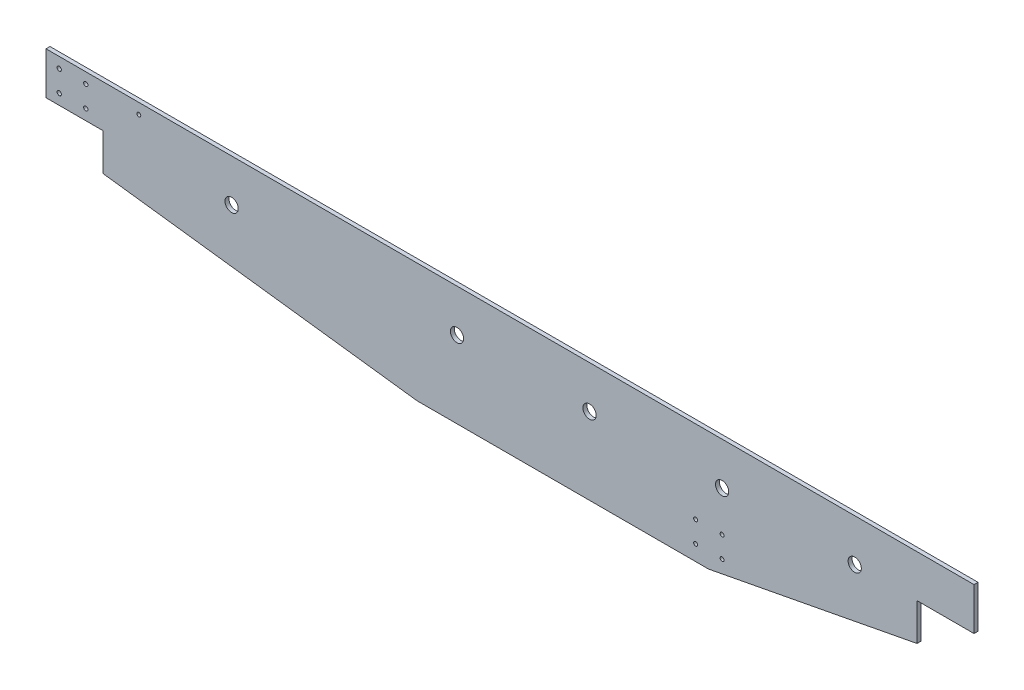
ISO-10303-21;
HEADER;
FILE_DESCRIPTION(('STEP AP214'),'2;1');
FILE_NAME('part.step','',(''),(''),'','','');
FILE_SCHEMA(('AUTOMOTIVE_DESIGN { 1 0 10303 214 1 1 1 1 }'));
ENDSEC;
DATA;
#1=APPLICATION_CONTEXT('core data for automotive mechanical design processes');
#2=APPLICATION_PROTOCOL_DEFINITION('international standard','automotive_design',2000,#1);
#3=PRODUCT_CONTEXT('',#1,'mechanical');
#4=PRODUCT('Part','Part','',(#3));
#5=PRODUCT_RELATED_PRODUCT_CATEGORY('part','',(#4));
#6=PRODUCT_DEFINITION_FORMATION('','',#4);
#7=PRODUCT_DEFINITION_CONTEXT('part definition',#1,'design');
#8=PRODUCT_DEFINITION('design','',#6,#7);
#9=PRODUCT_DEFINITION_SHAPE('','',#8);
#10=(LENGTH_UNIT() NAMED_UNIT(*) SI_UNIT(.MILLI.,.METRE.));
#11=(NAMED_UNIT(*) PLANE_ANGLE_UNIT() SI_UNIT($,.RADIAN.));
#12=(NAMED_UNIT(*) SI_UNIT($,.STERADIAN.) SOLID_ANGLE_UNIT());
#13=UNCERTAINTY_MEASURE_WITH_UNIT(LENGTH_MEASURE(1.E-05),#10,'distance_accuracy_value','');
#14=(GEOMETRIC_REPRESENTATION_CONTEXT(3) GLOBAL_UNCERTAINTY_ASSIGNED_CONTEXT((#13)) GLOBAL_UNIT_ASSIGNED_CONTEXT((#10,
#11,#12)) REPRESENTATION_CONTEXT('',''));
#15=CARTESIAN_POINT('',(0.,0.,0.));
#16=DIRECTION('',(0.,0.,1.));
#17=DIRECTION('',(1.,0.,0.));
#18=AXIS2_PLACEMENT_3D('',#15,#16,#17);
#19=CARTESIAN_POINT('',(0.,1.0096E-13,15.));
#20=DIRECTION('',(0.,0.,1.));
#21=DIRECTION('',(1.,0.,0.));
#22=AXIS2_PLACEMENT_3D('',#19,#20,#21);
#23=PLANE('',#22);
#24=CARTESIAN_POINT('',(-1700.,105.,15.));
#25=DIRECTION('',(0.,0.,1.));
#26=DIRECTION('',(1.,0.,0.));
#27=AXIS2_PLACEMENT_3D('',#24,#25,#26);
#28=CIRCLE('',#27,7.99999999999994);
#29=CARTESIAN_POINT('',(-1692.,105.,15.));
#30=VERTEX_POINT('',#29);
#31=EDGE_CURVE('E157',#30,#30,#28,.F.);
#32=ORIENTED_EDGE('',*,*,#31,.T.);
#33=EDGE_LOOP('',(#32));
#34=FACE_BOUND('',#33,.T.);
#35=CARTESIAN_POINT('',(-1600.,105.,15.));
#36=DIRECTION('',(0.,0.,1.));
#37=DIRECTION('',(1.,0.,0.));
#38=AXIS2_PLACEMENT_3D('',#35,#36,#37);
#39=CIRCLE('',#38,7.99999999999987);
#40=CARTESIAN_POINT('',(-1592.,105.,15.));
#41=VERTEX_POINT('',#40);
#42=EDGE_CURVE('E160',#41,#41,#39,.F.);
#43=ORIENTED_EDGE('',*,*,#42,.T.);
#44=EDGE_LOOP('',(#43));
#45=FACE_BOUND('',#44,.T.);
#46=CARTESIAN_POINT('',(-1700.,185.,15.));
#47=DIRECTION('',(0.,0.,1.));
#48=DIRECTION('',(1.,0.,0.));
#49=AXIS2_PLACEMENT_3D('',#46,#47,#48);
#50=CIRCLE('',#49,7.99999999999994);
#51=CARTESIAN_POINT('',(-1692.,185.,15.));
#52=VERTEX_POINT('',#51);
#53=EDGE_CURVE('E163',#52,#52,#50,.F.);
#54=ORIENTED_EDGE('',*,*,#53,.T.);
#55=EDGE_LOOP('',(#54));
#56=FACE_BOUND('',#55,.T.);
#57=CARTESIAN_POINT('',(-1600.,185.,15.));
#58=DIRECTION('',(0.,0.,1.));
#59=DIRECTION('',(1.,0.,0.));
#60=AXIS2_PLACEMENT_3D('',#57,#58,#59);
#61=CIRCLE('',#60,7.99999999999987);
#62=CARTESIAN_POINT('',(-1592.,185.,15.));
#63=VERTEX_POINT('',#62);
#64=EDGE_CURVE('E166',#63,#63,#61,.F.);
#65=ORIENTED_EDGE('',*,*,#64,.T.);
#66=EDGE_LOOP('',(#65));
#67=FACE_BOUND('',#66,.T.);
#68=CARTESIAN_POINT('',(800.,-167.,15.));
#69=DIRECTION('',(0.,0.,1.));
#70=DIRECTION('',(1.,0.,0.));
#71=AXIS2_PLACEMENT_3D('',#68,#69,#70);
#72=CIRCLE('',#71,7.49999999999993);
#73=CARTESIAN_POINT('',(807.5,-167.,15.));
#74=VERTEX_POINT('',#73);
#75=EDGE_CURVE('E169',#74,#74,#72,.F.);
#76=ORIENTED_EDGE('',*,*,#75,.T.);
#77=EDGE_LOOP('',(#76));
#78=FACE_BOUND('',#77,.T.);
#79=CARTESIAN_POINT('',(700.,-167.,15.));
#80=DIRECTION('',(0.,0.,1.));
#81=DIRECTION('',(1.,0.,0.));
#82=AXIS2_PLACEMENT_3D('',#79,#80,#81);
#83=CIRCLE('',#82,7.49999999999999);
#84=CARTESIAN_POINT('',(707.5,-167.,15.));
#85=VERTEX_POINT('',#84);
#86=EDGE_CURVE('E172',#85,#85,#83,.F.);
#87=ORIENTED_EDGE('',*,*,#86,.T.);
#88=EDGE_LOOP('',(#87));
#89=FACE_BOUND('',#88,.T.);
#90=CARTESIAN_POINT('',(800.,-86.9999999999999,15.));
#91=DIRECTION('',(0.,0.,1.));
#92=DIRECTION('',(1.,0.,0.));
#93=AXIS2_PLACEMENT_3D('',#90,#91,#92);
#94=CIRCLE('',#93,7.49999999999994);
#95=CARTESIAN_POINT('',(807.5,-86.9999999999999,15.));
#96=VERTEX_POINT('',#95);
#97=EDGE_CURVE('E175',#96,#96,#94,.F.);
#98=ORIENTED_EDGE('',*,*,#97,.T.);
#99=EDGE_LOOP('',(#98));
#100=FACE_BOUND('',#99,.T.);
#101=CARTESIAN_POINT('',(700.,-86.9999999999998,15.));
#102=DIRECTION('',(0.,0.,1.));
#103=DIRECTION('',(1.,0.,0.));
#104=AXIS2_PLACEMENT_3D('',#101,#102,#103);
#105=CIRCLE('',#104,7.50000000000001);
#106=CARTESIAN_POINT('',(707.5,-86.9999999999998,15.));
#107=VERTEX_POINT('',#106);
#108=EDGE_CURVE('E178',#107,#107,#105,.F.);
#109=ORIENTED_EDGE('',*,*,#108,.T.);
#110=EDGE_LOOP('',(#109));
#111=FACE_BOUND('',#110,.T.);
#112=CARTESIAN_POINT('',(-1400.,185.,15.));
#113=DIRECTION('',(0.,0.,-1.));
#114=DIRECTION('',(-1.,0.,0.));
#115=AXIS2_PLACEMENT_3D('',#112,#113,#114);
#116=CIRCLE('',#115,7.49999999999997);
#117=CARTESIAN_POINT('',(-1407.5,185.,15.));
#118=VERTEX_POINT('',#117);
#119=EDGE_CURVE('E181',#118,#118,#116,.T.);
#120=ORIENTED_EDGE('',*,*,#119,.T.);
#121=EDGE_LOOP('',(#120));
#122=FACE_BOUND('',#121,.T.);
#123=CARTESIAN_POINT('',(1300.,64.9999999999998,15.));
#124=DIRECTION('',(0.,0.,1.));
#125=DIRECTION('',(1.,0.,0.));
#126=AXIS2_PLACEMENT_3D('',#123,#124,#125);
#127=CIRCLE('',#126,25.);
#128=CARTESIAN_POINT('',(1325.,64.9999999999998,15.));
#129=VERTEX_POINT('',#128);
#130=EDGE_CURVE('E184',#129,#129,#127,.F.);
#131=ORIENTED_EDGE('',*,*,#130,.T.);
#132=EDGE_LOOP('',(#131));
#133=FACE_BOUND('',#132,.T.);
#134=CARTESIAN_POINT('',(800.,64.9999999999998,15.));
#135=DIRECTION('',(0.,0.,1.));
#136=DIRECTION('',(1.,0.,0.));
#137=AXIS2_PLACEMENT_3D('',#134,#135,#136);
#138=CIRCLE('',#137,25.);
#139=CARTESIAN_POINT('',(825.,64.9999999999998,15.));
#140=VERTEX_POINT('',#139);
#141=EDGE_CURVE('E187',#140,#140,#138,.F.);
#142=ORIENTED_EDGE('',*,*,#141,.T.);
#143=EDGE_LOOP('',(#142));
#144=FACE_BOUND('',#143,.T.);
#145=CARTESIAN_POINT('',(300.,64.9999999999998,15.));
#146=DIRECTION('',(0.,0.,1.));
#147=DIRECTION('',(1.,0.,0.));
#148=AXIS2_PLACEMENT_3D('',#145,#146,#147);
#149=CIRCLE('',#148,25.);
#150=CARTESIAN_POINT('',(325.,64.9999999999998,15.));
#151=VERTEX_POINT('',#150);
#152=EDGE_CURVE('E190',#151,#151,#149,.F.);
#153=ORIENTED_EDGE('',*,*,#152,.T.);
#154=EDGE_LOOP('',(#153));
#155=FACE_BOUND('',#154,.T.);
#156=CARTESIAN_POINT('',(-200.,64.9999999999998,15.));
#157=DIRECTION('',(0.,0.,1.));
#158=DIRECTION('',(1.,0.,0.));
#159=AXIS2_PLACEMENT_3D('',#156,#157,#158);
#160=CIRCLE('',#159,25.);
#161=CARTESIAN_POINT('',(-175.,64.9999999999998,15.));
#162=VERTEX_POINT('',#161);
#163=EDGE_CURVE('E192',#162,#162,#160,.F.);
#164=ORIENTED_EDGE('',*,*,#163,.T.);
#165=EDGE_LOOP('',(#164));
#166=FACE_BOUND('',#165,.T.);
#167=CARTESIAN_POINT('',(-1050.,64.9999999999998,15.));
#168=DIRECTION('',(0.,0.,1.));
#169=DIRECTION('',(1.,0.,0.));
#170=AXIS2_PLACEMENT_3D('',#167,#168,#169);
#171=CIRCLE('',#170,25.);
#172=CARTESIAN_POINT('',(-1025.,64.9999999999998,15.));
#173=VERTEX_POINT('',#172);
#174=EDGE_CURVE('E21',#173,#173,#171,.F.);
#175=ORIENTED_EDGE('',*,*,#174,.T.);
#176=EDGE_LOOP('',(#175));
#177=FACE_BOUND('',#176,.T.);
#178=DIRECTION('',(1.,0.,0.));
#179=VECTOR('',#178,1.);
#180=CARTESIAN_POINT('',(-1750.,225.,15.));
#181=LINE('',#180,#179);
#182=CARTESIAN_POINT('',(-1750.,225.,15.));
#183=VERTEX_POINT('',#182);
#184=CARTESIAN_POINT('',(1750.,225.,15.));
#185=VERTEX_POINT('',#184);
#186=EDGE_CURVE('E222',#183,#185,#181,.T.);
#187=ORIENTED_EDGE('',*,*,#186,.F.);
#188=DIRECTION('',(0.,1.,0.));
#189=VECTOR('',#188,1.);
#190=CARTESIAN_POINT('',(-1750.,-225.,15.));
#191=LINE('',#190,#189);
#192=CARTESIAN_POINT('',(-1750.,65.,15.));
#193=VERTEX_POINT('',#192);
#194=EDGE_CURVE('E218',#193,#183,#191,.T.);
#195=ORIENTED_EDGE('',*,*,#194,.F.);
#196=DIRECTION('',(1.,0.,0.));
#197=VECTOR('',#196,1.);
#198=CARTESIAN_POINT('',(-1535.,65.,15.));
#199=LINE('',#198,#197);
#200=CARTESIAN_POINT('',(-1535.,65.,15.));
#201=VERTEX_POINT('',#200);
#202=EDGE_CURVE('E211',#193,#201,#199,.T.);
#203=ORIENTED_EDGE('',*,*,#202,.T.);
#204=DIRECTION('',(0.,1.,0.));
#205=VECTOR('',#204,1.);
#206=CARTESIAN_POINT('',(-1535.,-75.,15.));
#207=LINE('',#206,#205);
#208=CARTESIAN_POINT('',(-1535.,-75.0000000000001,15.));
#209=VERTEX_POINT('',#208);
#210=EDGE_CURVE('E206',#201,#209,#207,.F.);
#211=ORIENTED_EDGE('',*,*,#210,.T.);
#212=DIRECTION('',(-0.992072745212236,0.125664904436596,0.));
#213=VECTOR('',#212,1.);
#214=CARTESIAN_POINT('',(-350.811682275086,-225.,15.));
#215=LINE('',#214,#213);
#216=CARTESIAN_POINT('',(-350.811682275089,-225.,15.));
#217=VERTEX_POINT('',#216);
#218=EDGE_CURVE('E98',#209,#217,#215,.F.);
#219=ORIENTED_EDGE('',*,*,#218,.T.);
#220=DIRECTION('',(1.,0.,0.));
#221=VECTOR('',#220,1.);
#222=CARTESIAN_POINT('',(1750.,-225.,15.));
#223=LINE('',#222,#221);
#224=CARTESIAN_POINT('',(749.188317724915,-225.,15.));
#225=VERTEX_POINT('',#224);
#226=EDGE_CURVE('E96',#225,#217,#223,.F.);
#227=ORIENTED_EDGE('',*,*,#226,.F.);
#228=DIRECTION('',(-0.982264602843857,-0.1875,0.));
#229=VECTOR('',#228,1.);
#230=CARTESIAN_POINT('',(1535.,-75.,15.));
#231=LINE('',#230,#229);
#232=CARTESIAN_POINT('',(1535.,-75.,15.));
#233=VERTEX_POINT('',#232);
#234=EDGE_CURVE('E93',#225,#233,#231,.F.);
#235=ORIENTED_EDGE('',*,*,#234,.T.);
#236=DIRECTION('',(0.,1.,0.));
#237=VECTOR('',#236,1.);
#238=CARTESIAN_POINT('',(1535.,65.,15.));
#239=LINE('',#238,#237);
#240=CARTESIAN_POINT('',(1535.,65.,15.));
#241=VERTEX_POINT('',#240);
#242=EDGE_CURVE('E234',#233,#241,#239,.T.);
#243=ORIENTED_EDGE('',*,*,#242,.T.);
#244=DIRECTION('',(1.,0.,0.));
#245=VECTOR('',#244,1.);
#246=CARTESIAN_POINT('',(1750.,65.0000000000001,15.));
#247=LINE('',#246,#245);
#248=CARTESIAN_POINT('',(1750.,65.0000000000001,15.));
#249=VERTEX_POINT('',#248);
#250=EDGE_CURVE('E229',#241,#249,#247,.T.);
#251=ORIENTED_EDGE('',*,*,#250,.T.);
#252=DIRECTION('',(0.,1.,0.));
#253=VECTOR('',#252,1.);
#254=CARTESIAN_POINT('',(1750.,225.,15.));
#255=LINE('',#254,#253);
#256=EDGE_CURVE('E224',#185,#249,#255,.F.);
#257=ORIENTED_EDGE('',*,*,#256,.F.);
#258=EDGE_LOOP('',(#187,#195,#203,#211,#219,#227,#235,#243,#251,#257));
#259=FACE_BOUND('',#258,.T.);
#260=ADVANCED_FACE('F17',(#34,#45,#56,#67,#78,#89,#100,#111,#122,#133,#144,#155,#166,#177,#259),
#23,.T.);
#261=CARTESIAN_POINT('',(1750.,-225.,0.));
#262=DIRECTION('',(0.,-1.,0.));
#263=DIRECTION('',(0.,0.,-1.));
#264=AXIS2_PLACEMENT_3D('',#261,#262,#263);
#265=PLANE('',#264);
#266=DIRECTION('',(0.,0.,1.));
#267=VECTOR('',#266,1.);
#268=CARTESIAN_POINT('',(749.188317724914,-225.,15.));
#269=LINE('',#268,#267);
#270=CARTESIAN_POINT('',(749.188317724915,-225.,0.));
#271=VERTEX_POINT('',#270);
#272=EDGE_CURVE('E103',#271,#225,#269,.T.);
#273=ORIENTED_EDGE('',*,*,#272,.T.);
#274=ORIENTED_EDGE('',*,*,#226,.T.);
#275=DIRECTION('',(0.,0.,1.));
#276=VECTOR('',#275,1.);
#277=CARTESIAN_POINT('',(-350.811682275086,-225.,15.));
#278=LINE('',#277,#276);
#279=CARTESIAN_POINT('',(-350.811682275092,-224.999999999999,0.));
#280=VERTEX_POINT('',#279);
#281=EDGE_CURVE('E197',#217,#280,#278,.F.);
#282=ORIENTED_EDGE('',*,*,#281,.T.);
#283=DIRECTION('',(1.,0.,0.));
#284=VECTOR('',#283,1.);
#285=CARTESIAN_POINT('',(0.,-225.,0.));
#286=LINE('',#285,#284);
#287=EDGE_CURVE('E114',#280,#271,#286,.T.);
#288=ORIENTED_EDGE('',*,*,#287,.T.);
#289=EDGE_LOOP('',(#273,#274,#282,#288));
#290=FACE_BOUND('',#289,.T.);
#291=ADVANCED_FACE('F113',(#290),#265,.T.);
#292=CARTESIAN_POINT('',(1535.,-75.,15.));
#293=DIRECTION('',(-0.1875,0.982264602843857,0.));
#294=DIRECTION('',(-0.982264602843857,-0.1875,0.));
#295=AXIS2_PLACEMENT_3D('',#292,#293,#294);
#296=PLANE('',#295);
#297=DIRECTION('',(0.,0.,1.));
#298=VECTOR('',#297,1.);
#299=CARTESIAN_POINT('',(1535.,-75.,15.));
#300=LINE('',#299,#298);
#301=CARTESIAN_POINT('',(1535.,-75.,0.));
#302=VERTEX_POINT('',#301);
#303=EDGE_CURVE('E110',#302,#233,#300,.T.);
#304=ORIENTED_EDGE('',*,*,#303,.T.);
#305=ORIENTED_EDGE('',*,*,#234,.F.);
#306=ORIENTED_EDGE('',*,*,#272,.F.);
#307=DIRECTION('',(0.982264602843857,0.1875,0.));
#308=VECTOR('',#307,1.);
#309=CARTESIAN_POINT('',(749.188317724914,-225.,0.));
#310=LINE('',#309,#308);
#311=EDGE_CURVE('E249',#271,#302,#310,.T.);
#312=ORIENTED_EDGE('',*,*,#311,.T.);
#313=EDGE_LOOP('',(#304,#305,#306,#312));
#314=FACE_BOUND('',#313,.T.);
#315=ADVANCED_FACE('F107',(#314),#296,.F.);
#316=CARTESIAN_POINT('',(1535.,65.,15.));
#317=DIRECTION('',(-1.,0.,0.));
#318=DIRECTION('',(0.,0.,1.));
#319=AXIS2_PLACEMENT_3D('',#316,#317,#318);
#320=PLANE('',#319);
#321=DIRECTION('',(0.,0.,1.));
#322=VECTOR('',#321,1.);
#323=CARTESIAN_POINT('',(1535.,65.0000000000001,15.));
#324=LINE('',#323,#322);
#325=CARTESIAN_POINT('',(1535.,65.,0.));
#326=VERTEX_POINT('',#325);
#327=EDGE_CURVE('E231',#326,#241,#324,.T.);
#328=ORIENTED_EDGE('',*,*,#327,.T.);
#329=ORIENTED_EDGE('',*,*,#242,.F.);
#330=ORIENTED_EDGE('',*,*,#303,.F.);
#331=DIRECTION('',(0.,1.,0.));
#332=VECTOR('',#331,1.);
#333=CARTESIAN_POINT('',(1535.,1.065814E-13,0.));
#334=LINE('',#333,#332);
#335=EDGE_CURVE('E246',#302,#326,#334,.T.);
#336=ORIENTED_EDGE('',*,*,#335,.T.);
#337=EDGE_LOOP('',(#328,#329,#330,#336));
#338=FACE_BOUND('',#337,.T.);
#339=ADVANCED_FACE('F244',(#338),#320,.F.);
#340=CARTESIAN_POINT('',(1750.,65.0000000000001,15.));
#341=DIRECTION('',(0.,1.,0.));
#342=DIRECTION('',(0.,0.,1.));
#343=AXIS2_PLACEMENT_3D('',#340,#341,#342);
#344=PLANE('',#343);
#345=DIRECTION('',(0.,0.,-1.));
#346=VECTOR('',#345,1.);
#347=CARTESIAN_POINT('',(1750.,65.0000000000001,0.));
#348=LINE('',#347,#346);
#349=CARTESIAN_POINT('',(1750.,65.0000000000001,0.));
#350=VERTEX_POINT('',#349);
#351=EDGE_CURVE('E227',#249,#350,#348,.T.);
#352=ORIENTED_EDGE('',*,*,#351,.F.);
#353=ORIENTED_EDGE('',*,*,#250,.F.);
#354=ORIENTED_EDGE('',*,*,#327,.F.);
#355=DIRECTION('',(1.,0.,0.));
#356=VECTOR('',#355,1.);
#357=CARTESIAN_POINT('',(0.,65.,0.));
#358=LINE('',#357,#356);
#359=EDGE_CURVE('E248',#326,#350,#358,.T.);
#360=ORIENTED_EDGE('',*,*,#359,.T.);
#361=EDGE_LOOP('',(#352,#353,#354,#360));
#362=FACE_BOUND('',#361,.T.);
#363=ADVANCED_FACE('F240',(#362),#344,.F.);
#364=CARTESIAN_POINT('',(1750.,225.,0.));
#365=DIRECTION('',(1.,0.,0.));
#366=DIRECTION('',(0.,0.,-1.));
#367=AXIS2_PLACEMENT_3D('',#364,#365,#366);
#368=PLANE('',#367);
#369=DIRECTION('',(0.,0.,1.));
#370=VECTOR('',#369,1.);
#371=CARTESIAN_POINT('',(1750.,225.,0.));
#372=LINE('',#371,#370);
#373=CARTESIAN_POINT('',(1750.,225.,0.));
#374=VERTEX_POINT('',#373);
#375=EDGE_CURVE('E220',#185,#374,#372,.F.);
#376=ORIENTED_EDGE('',*,*,#375,.F.);
#377=ORIENTED_EDGE('',*,*,#256,.T.);
#378=ORIENTED_EDGE('',*,*,#351,.T.);
#379=DIRECTION('',(0.,1.,0.));
#380=VECTOR('',#379,1.);
#381=CARTESIAN_POINT('',(1750.,1.065814E-13,0.));
#382=LINE('',#381,#380);
#383=EDGE_CURVE('E251',#350,#374,#382,.T.);
#384=ORIENTED_EDGE('',*,*,#383,.T.);
#385=EDGE_LOOP('',(#376,#377,#378,#384));
#386=FACE_BOUND('',#385,.T.);
#387=ADVANCED_FACE('F288',(#386),#368,.T.);
#388=CARTESIAN_POINT('',(-1750.,225.,0.));
#389=DIRECTION('',(0.,1.,0.));
#390=DIRECTION('',(0.,0.,1.));
#391=AXIS2_PLACEMENT_3D('',#388,#389,#390);
#392=PLANE('',#391);
#393=DIRECTION('',(1.,0.,0.));
#394=VECTOR('',#393,1.);
#395=CARTESIAN_POINT('',(0.,225.,0.));
#396=LINE('',#395,#394);
#397=CARTESIAN_POINT('',(-1750.,225.,0.));
#398=VERTEX_POINT('',#397);
#399=EDGE_CURVE('E256',#374,#398,#396,.F.);
#400=ORIENTED_EDGE('',*,*,#399,.T.);
#401=DIRECTION('',(0.,0.,1.));
#402=VECTOR('',#401,1.);
#403=CARTESIAN_POINT('',(-1750.,225.,0.));
#404=LINE('',#403,#402);
#405=EDGE_CURVE('E216',#183,#398,#404,.F.);
#406=ORIENTED_EDGE('',*,*,#405,.F.);
#407=ORIENTED_EDGE('',*,*,#186,.T.);
#408=ORIENTED_EDGE('',*,*,#375,.T.);
#409=EDGE_LOOP('',(#400,#406,#407,#408));
#410=FACE_BOUND('',#409,.T.);
#411=ADVANCED_FACE('F284',(#410),#392,.T.);
#412=CARTESIAN_POINT('',(-1750.,-225.,0.));
#413=DIRECTION('',(-1.,0.,0.));
#414=DIRECTION('',(0.,0.,1.));
#415=AXIS2_PLACEMENT_3D('',#412,#413,#414);
#416=PLANE('',#415);
#417=ORIENTED_EDGE('',*,*,#405,.T.);
#418=DIRECTION('',(0.,1.,0.));
#419=VECTOR('',#418,1.);
#420=CARTESIAN_POINT('',(-1750.,1.065814E-13,0.));
#421=LINE('',#420,#419);
#422=CARTESIAN_POINT('',(-1750.,65.,0.));
#423=VERTEX_POINT('',#422);
#424=EDGE_CURVE('E259',#398,#423,#421,.F.);
#425=ORIENTED_EDGE('',*,*,#424,.T.);
#426=DIRECTION('',(0.,0.,1.));
#427=VECTOR('',#426,1.);
#428=CARTESIAN_POINT('',(-1750.,65.,15.));
#429=LINE('',#428,#427);
#430=EDGE_CURVE('E213',#423,#193,#429,.T.);
#431=ORIENTED_EDGE('',*,*,#430,.T.);
#432=ORIENTED_EDGE('',*,*,#194,.T.);
#433=EDGE_LOOP('',(#417,#425,#431,#432));
#434=FACE_BOUND('',#433,.T.);
#435=ADVANCED_FACE('F281',(#434),#416,.T.);
#436=CARTESIAN_POINT('',(-1535.,65.,15.));
#437=DIRECTION('',(0.,1.,0.));
#438=DIRECTION('',(0.,0.,1.));
#439=AXIS2_PLACEMENT_3D('',#436,#437,#438);
#440=PLANE('',#439);
#441=DIRECTION('',(0.,0.,-1.));
#442=VECTOR('',#441,1.);
#443=CARTESIAN_POINT('',(-1535.,65.,15.));
#444=LINE('',#443,#442);
#445=CARTESIAN_POINT('',(-1535.,65.,0.));
#446=VERTEX_POINT('',#445);
#447=EDGE_CURVE('E208',#446,#201,#444,.F.);
#448=ORIENTED_EDGE('',*,*,#447,.T.);
#449=ORIENTED_EDGE('',*,*,#202,.F.);
#450=ORIENTED_EDGE('',*,*,#430,.F.);
#451=DIRECTION('',(1.,0.,0.));
#452=VECTOR('',#451,1.);
#453=CARTESIAN_POINT('',(0.,65.,0.));
#454=LINE('',#453,#452);
#455=EDGE_CURVE('E262',#423,#446,#454,.T.);
#456=ORIENTED_EDGE('',*,*,#455,.T.);
#457=EDGE_LOOP('',(#448,#449,#450,#456));
#458=FACE_BOUND('',#457,.T.);
#459=ADVANCED_FACE('F277',(#458),#440,.F.);
#460=CARTESIAN_POINT('',(-1535.,-75.,15.));
#461=DIRECTION('',(1.,0.,0.));
#462=DIRECTION('',(0.,0.,-1.));
#463=AXIS2_PLACEMENT_3D('',#460,#461,#462);
#464=PLANE('',#463);
#465=DIRECTION('',(0.,0.,1.));
#466=VECTOR('',#465,1.);
#467=CARTESIAN_POINT('',(-1535.,-75.0000000000004,15.));
#468=LINE('',#467,#466);
#469=CARTESIAN_POINT('',(-1535.,-75.0000000000001,0.));
#470=VERTEX_POINT('',#469);
#471=EDGE_CURVE('E36',#470,#209,#468,.T.);
#472=ORIENTED_EDGE('',*,*,#471,.T.);
#473=ORIENTED_EDGE('',*,*,#210,.F.);
#474=ORIENTED_EDGE('',*,*,#447,.F.);
#475=DIRECTION('',(0.,1.,0.));
#476=VECTOR('',#475,1.);
#477=CARTESIAN_POINT('',(-1535.,1.065814E-13,0.));
#478=LINE('',#477,#476);
#479=EDGE_CURVE('E265',#446,#470,#478,.F.);
#480=ORIENTED_EDGE('',*,*,#479,.T.);
#481=EDGE_LOOP('',(#472,#473,#474,#480));
#482=FACE_BOUND('',#481,.T.);
#483=ADVANCED_FACE('F273',(#482),#464,.F.);
#484=CARTESIAN_POINT('',(-350.811682275086,-225.,15.));
#485=DIRECTION('',(0.125664904436596,0.992072745212236,0.));
#486=DIRECTION('',(-0.992072745212236,0.125664904436596,0.));
#487=AXIS2_PLACEMENT_3D('',#484,#485,#486);
#488=PLANE('',#487);
#489=ORIENTED_EDGE('',*,*,#281,.F.);
#490=ORIENTED_EDGE('',*,*,#218,.F.);
#491=ORIENTED_EDGE('',*,*,#471,.F.);
#492=DIRECTION('',(0.992072745212235,-0.125664904436596,0.));
#493=VECTOR('',#492,1.);
#494=CARTESIAN_POINT('',(-1535.,-75.,0.));
#495=LINE('',#494,#493);
#496=EDGE_CURVE('E156',#470,#280,#495,.T.);
#497=ORIENTED_EDGE('',*,*,#496,.T.);
#498=EDGE_LOOP('',(#489,#490,#491,#497));
#499=FACE_BOUND('',#498,.T.);
#500=ADVANCED_FACE('F268',(#499),#488,.F.);
#501=CARTESIAN_POINT('',(-1050.,64.9999999999998,0.));
#502=DIRECTION('',(0.,0.,1.));
#503=DIRECTION('',(1.,0.,0.));
#504=AXIS2_PLACEMENT_3D('',#501,#502,#503);
#505=CYLINDRICAL_SURFACE('',#504,25.);
#506=CARTESIAN_POINT('',(-1050.,64.9999999999998,0.));
#507=DIRECTION('',(0.,0.,1.));
#508=DIRECTION('',(1.,0.,0.));
#509=AXIS2_PLACEMENT_3D('',#506,#507,#508);
#510=CIRCLE('',#509,25.);
#511=CARTESIAN_POINT('',(-1025.,64.9999999999998,0.));
#512=VERTEX_POINT('',#511);
#513=EDGE_CURVE('E153',#512,#512,#510,.F.);
#514=ORIENTED_EDGE('',*,*,#513,.T.);
#515=EDGE_LOOP('',(#514));
#516=FACE_BOUND('',#515,.T.);
#517=ORIENTED_EDGE('',*,*,#174,.F.);
#518=EDGE_LOOP('',(#517));
#519=FACE_BOUND('',#518,.T.);
#520=ADVANCED_FACE('F325',(#516,#519),#505,.F.);
#521=CARTESIAN_POINT('',(-200.,64.9999999999998,0.));
#522=DIRECTION('',(0.,0.,1.));
#523=DIRECTION('',(1.,0.,0.));
#524=AXIS2_PLACEMENT_3D('',#521,#522,#523);
#525=CYLINDRICAL_SURFACE('',#524,25.);
#526=CARTESIAN_POINT('',(-200.,64.9999999999998,0.));
#527=DIRECTION('',(0.,0.,1.));
#528=DIRECTION('',(1.,0.,0.));
#529=AXIS2_PLACEMENT_3D('',#526,#527,#528);
#530=CIRCLE('',#529,25.);
#531=CARTESIAN_POINT('',(-175.,64.9999999999998,0.));
#532=VERTEX_POINT('',#531);
#533=EDGE_CURVE('E150',#532,#532,#530,.F.);
#534=ORIENTED_EDGE('',*,*,#533,.T.);
#535=EDGE_LOOP('',(#534));
#536=FACE_BOUND('',#535,.T.);
#537=ORIENTED_EDGE('',*,*,#163,.F.);
#538=EDGE_LOOP('',(#537));
#539=FACE_BOUND('',#538,.T.);
#540=ADVANCED_FACE('F321',(#536,#539),#525,.F.);
#541=CARTESIAN_POINT('',(300.,64.9999999999998,0.));
#542=DIRECTION('',(0.,0.,1.));
#543=DIRECTION('',(1.,0.,0.));
#544=AXIS2_PLACEMENT_3D('',#541,#542,#543);
#545=CYLINDRICAL_SURFACE('',#544,25.);
#546=CARTESIAN_POINT('',(300.,64.9999999999998,0.));
#547=DIRECTION('',(0.,0.,1.));
#548=DIRECTION('',(1.,0.,0.));
#549=AXIS2_PLACEMENT_3D('',#546,#547,#548);
#550=CIRCLE('',#549,25.);
#551=CARTESIAN_POINT('',(325.,64.9999999999998,0.));
#552=VERTEX_POINT('',#551);
#553=EDGE_CURVE('E147',#552,#552,#550,.F.);
#554=ORIENTED_EDGE('',*,*,#553,.T.);
#555=EDGE_LOOP('',(#554));
#556=FACE_BOUND('',#555,.T.);
#557=ORIENTED_EDGE('',*,*,#152,.F.);
#558=EDGE_LOOP('',(#557));
#559=FACE_BOUND('',#558,.T.);
#560=ADVANCED_FACE('F317',(#556,#559),#545,.F.);
#561=CARTESIAN_POINT('',(800.,64.9999999999998,0.));
#562=DIRECTION('',(0.,0.,1.));
#563=DIRECTION('',(1.,0.,0.));
#564=AXIS2_PLACEMENT_3D('',#561,#562,#563);
#565=CYLINDRICAL_SURFACE('',#564,25.);
#566=CARTESIAN_POINT('',(800.,64.9999999999998,0.));
#567=DIRECTION('',(0.,0.,1.));
#568=DIRECTION('',(1.,0.,0.));
#569=AXIS2_PLACEMENT_3D('',#566,#567,#568);
#570=CIRCLE('',#569,25.);
#571=CARTESIAN_POINT('',(825.,64.9999999999998,0.));
#572=VERTEX_POINT('',#571);
#573=EDGE_CURVE('E144',#572,#572,#570,.F.);
#574=ORIENTED_EDGE('',*,*,#573,.T.);
#575=EDGE_LOOP('',(#574));
#576=FACE_BOUND('',#575,.T.);
#577=ORIENTED_EDGE('',*,*,#141,.F.);
#578=EDGE_LOOP('',(#577));
#579=FACE_BOUND('',#578,.T.);
#580=ADVANCED_FACE('F313',(#576,#579),#565,.F.);
#581=CARTESIAN_POINT('',(1300.,64.9999999999998,0.));
#582=DIRECTION('',(0.,0.,1.));
#583=DIRECTION('',(1.,0.,0.));
#584=AXIS2_PLACEMENT_3D('',#581,#582,#583);
#585=CYLINDRICAL_SURFACE('',#584,25.);
#586=CARTESIAN_POINT('',(1300.,64.9999999999998,0.));
#587=DIRECTION('',(0.,0.,1.));
#588=DIRECTION('',(1.,0.,0.));
#589=AXIS2_PLACEMENT_3D('',#586,#587,#588);
#590=CIRCLE('',#589,25.);
#591=CARTESIAN_POINT('',(1325.,64.9999999999998,0.));
#592=VERTEX_POINT('',#591);
#593=EDGE_CURVE('E141',#592,#592,#590,.F.);
#594=ORIENTED_EDGE('',*,*,#593,.T.);
#595=EDGE_LOOP('',(#594));
#596=FACE_BOUND('',#595,.T.);
#597=ORIENTED_EDGE('',*,*,#130,.F.);
#598=EDGE_LOOP('',(#597));
#599=FACE_BOUND('',#598,.T.);
#600=ADVANCED_FACE('F309',(#596,#599),#585,.F.);
#601=CARTESIAN_POINT('',(-1400.,185.,15.));
#602=DIRECTION('',(0.,0.,-1.));
#603=DIRECTION('',(-1.,0.,0.));
#604=AXIS2_PLACEMENT_3D('',#601,#602,#603);
#605=CYLINDRICAL_SURFACE('',#604,7.49999999999997);
#606=CARTESIAN_POINT('',(-1400.,185.,0.));
#607=DIRECTION('',(0.,0.,-1.));
#608=DIRECTION('',(-1.,0.,0.));
#609=AXIS2_PLACEMENT_3D('',#606,#607,#608);
#610=CIRCLE('',#609,7.49999999999997);
#611=CARTESIAN_POINT('',(-1407.5,185.,0.));
#612=VERTEX_POINT('',#611);
#613=EDGE_CURVE('E138',#612,#612,#610,.T.);
#614=ORIENTED_EDGE('',*,*,#613,.T.);
#615=EDGE_LOOP('',(#614));
#616=FACE_BOUND('',#615,.T.);
#617=ORIENTED_EDGE('',*,*,#119,.F.);
#618=EDGE_LOOP('',(#617));
#619=FACE_BOUND('',#618,.T.);
#620=ADVANCED_FACE('F312',(#616,#619),#605,.F.);
#621=CARTESIAN_POINT('',(700.,-86.9999999999998,0.));
#622=DIRECTION('',(0.,0.,1.));
#623=DIRECTION('',(1.,0.,0.));
#624=AXIS2_PLACEMENT_3D('',#621,#622,#623);
#625=CYLINDRICAL_SURFACE('',#624,7.50000000000001);
#626=ORIENTED_EDGE('',*,*,#108,.F.);
#627=EDGE_LOOP('',(#626));
#628=FACE_BOUND('',#627,.T.);
#629=CARTESIAN_POINT('',(700.,-86.9999999999998,0.));
#630=DIRECTION('',(0.,0.,1.));
#631=DIRECTION('',(1.,0.,0.));
#632=AXIS2_PLACEMENT_3D('',#629,#630,#631);
#633=CIRCLE('',#632,7.50000000000001);
#634=CARTESIAN_POINT('',(707.5,-86.9999999999998,0.));
#635=VERTEX_POINT('',#634);
#636=EDGE_CURVE('E135',#635,#635,#633,.F.);
#637=ORIENTED_EDGE('',*,*,#636,.T.);
#638=EDGE_LOOP('',(#637));
#639=FACE_BOUND('',#638,.T.);
#640=ADVANCED_FACE('F382',(#628,#639),#625,.F.);
#641=CARTESIAN_POINT('',(800.,-86.9999999999999,0.));
#642=DIRECTION('',(0.,0.,1.));
#643=DIRECTION('',(1.,0.,0.));
#644=AXIS2_PLACEMENT_3D('',#641,#642,#643);
#645=CYLINDRICAL_SURFACE('',#644,7.49999999999994);
#646=ORIENTED_EDGE('',*,*,#97,.F.);
#647=EDGE_LOOP('',(#646));
#648=FACE_BOUND('',#647,.T.);
#649=CARTESIAN_POINT('',(800.,-86.9999999999999,0.));
#650=DIRECTION('',(0.,0.,1.));
#651=DIRECTION('',(1.,0.,0.));
#652=AXIS2_PLACEMENT_3D('',#649,#650,#651);
#653=CIRCLE('',#652,7.49999999999994);
#654=CARTESIAN_POINT('',(807.5,-86.9999999999999,0.));
#655=VERTEX_POINT('',#654);
#656=EDGE_CURVE('E132',#655,#655,#653,.F.);
#657=ORIENTED_EDGE('',*,*,#656,.T.);
#658=EDGE_LOOP('',(#657));
#659=FACE_BOUND('',#658,.T.);
#660=ADVANCED_FACE('F390',(#648,#659),#645,.F.);
#661=CARTESIAN_POINT('',(700.,-167.,0.));
#662=DIRECTION('',(0.,0.,1.));
#663=DIRECTION('',(1.,0.,0.));
#664=AXIS2_PLACEMENT_3D('',#661,#662,#663);
#665=CYLINDRICAL_SURFACE('',#664,7.49999999999999);
#666=ORIENTED_EDGE('',*,*,#86,.F.);
#667=EDGE_LOOP('',(#666));
#668=FACE_BOUND('',#667,.T.);
#669=CARTESIAN_POINT('',(700.,-167.,0.));
#670=DIRECTION('',(0.,0.,1.));
#671=DIRECTION('',(1.,0.,0.));
#672=AXIS2_PLACEMENT_3D('',#669,#670,#671);
#673=CIRCLE('',#672,7.49999999999999);
#674=CARTESIAN_POINT('',(707.5,-167.,0.));
#675=VERTEX_POINT('',#674);
#676=EDGE_CURVE('E129',#675,#675,#673,.F.);
#677=ORIENTED_EDGE('',*,*,#676,.T.);
#678=EDGE_LOOP('',(#677));
#679=FACE_BOUND('',#678,.T.);
#680=ADVANCED_FACE('F398',(#668,#679),#665,.F.);
#681=CARTESIAN_POINT('',(800.,-167.,0.));
#682=DIRECTION('',(0.,0.,1.));
#683=DIRECTION('',(1.,0.,0.));
#684=AXIS2_PLACEMENT_3D('',#681,#682,#683);
#685=CYLINDRICAL_SURFACE('',#684,7.49999999999993);
#686=ORIENTED_EDGE('',*,*,#75,.F.);
#687=EDGE_LOOP('',(#686));
#688=FACE_BOUND('',#687,.T.);
#689=CARTESIAN_POINT('',(800.,-167.,0.));
#690=DIRECTION('',(0.,0.,1.));
#691=DIRECTION('',(1.,0.,0.));
#692=AXIS2_PLACEMENT_3D('',#689,#690,#691);
#693=CIRCLE('',#692,7.49999999999993);
#694=CARTESIAN_POINT('',(807.5,-167.,0.));
#695=VERTEX_POINT('',#694);
#696=EDGE_CURVE('E126',#695,#695,#693,.F.);
#697=ORIENTED_EDGE('',*,*,#696,.T.);
#698=EDGE_LOOP('',(#697));
#699=FACE_BOUND('',#698,.T.);
#700=ADVANCED_FACE('F406',(#688,#699),#685,.F.);
#701=CARTESIAN_POINT('',(-1600.,185.,0.));
#702=DIRECTION('',(0.,0.,1.));
#703=DIRECTION('',(1.,0.,0.));
#704=AXIS2_PLACEMENT_3D('',#701,#702,#703);
#705=CYLINDRICAL_SURFACE('',#704,7.99999999999987);
#706=ORIENTED_EDGE('',*,*,#64,.F.);
#707=EDGE_LOOP('',(#706));
#708=FACE_BOUND('',#707,.T.);
#709=CARTESIAN_POINT('',(-1600.,185.,0.));
#710=DIRECTION('',(0.,0.,1.));
#711=DIRECTION('',(1.,0.,0.));
#712=AXIS2_PLACEMENT_3D('',#709,#710,#711);
#713=CIRCLE('',#712,7.99999999999987);
#714=CARTESIAN_POINT('',(-1592.,185.,0.));
#715=VERTEX_POINT('',#714);
#716=EDGE_CURVE('E123',#715,#715,#713,.F.);
#717=ORIENTED_EDGE('',*,*,#716,.T.);
#718=EDGE_LOOP('',(#717));
#719=FACE_BOUND('',#718,.T.);
#720=ADVANCED_FACE('F414',(#708,#719),#705,.F.);
#721=CARTESIAN_POINT('',(-1700.,185.,0.));
#722=DIRECTION('',(0.,0.,1.));
#723=DIRECTION('',(1.,0.,0.));
#724=AXIS2_PLACEMENT_3D('',#721,#722,#723);
#725=CYLINDRICAL_SURFACE('',#724,7.99999999999994);
#726=ORIENTED_EDGE('',*,*,#53,.F.);
#727=EDGE_LOOP('',(#726));
#728=FACE_BOUND('',#727,.T.);
#729=CARTESIAN_POINT('',(-1700.,185.,0.));
#730=DIRECTION('',(0.,0.,1.));
#731=DIRECTION('',(1.,0.,0.));
#732=AXIS2_PLACEMENT_3D('',#729,#730,#731);
#733=CIRCLE('',#732,7.99999999999994);
#734=CARTESIAN_POINT('',(-1692.,185.,0.));
#735=VERTEX_POINT('',#734);
#736=EDGE_CURVE('E120',#735,#735,#733,.F.);
#737=ORIENTED_EDGE('',*,*,#736,.T.);
#738=EDGE_LOOP('',(#737));
#739=FACE_BOUND('',#738,.T.);
#740=ADVANCED_FACE('F422',(#728,#739),#725,.F.);
#741=CARTESIAN_POINT('',(-1600.,105.,0.));
#742=DIRECTION('',(0.,0.,1.));
#743=DIRECTION('',(1.,0.,0.));
#744=AXIS2_PLACEMENT_3D('',#741,#742,#743);
#745=CYLINDRICAL_SURFACE('',#744,7.99999999999987);
#746=ORIENTED_EDGE('',*,*,#42,.F.);
#747=EDGE_LOOP('',(#746));
#748=FACE_BOUND('',#747,.T.);
#749=CARTESIAN_POINT('',(-1600.,105.,0.));
#750=DIRECTION('',(0.,0.,1.));
#751=DIRECTION('',(1.,0.,0.));
#752=AXIS2_PLACEMENT_3D('',#749,#750,#751);
#753=CIRCLE('',#752,7.99999999999987);
#754=CARTESIAN_POINT('',(-1592.,105.,0.));
#755=VERTEX_POINT('',#754);
#756=EDGE_CURVE('E27',#755,#755,#753,.F.);
#757=ORIENTED_EDGE('',*,*,#756,.T.);
#758=EDGE_LOOP('',(#757));
#759=FACE_BOUND('',#758,.T.);
#760=ADVANCED_FACE('F304',(#748,#759),#745,.F.);
#761=CARTESIAN_POINT('',(-1700.,105.,0.));
#762=DIRECTION('',(0.,0.,1.));
#763=DIRECTION('',(1.,0.,0.));
#764=AXIS2_PLACEMENT_3D('',#761,#762,#763);
#765=CYLINDRICAL_SURFACE('',#764,7.99999999999994);
#766=ORIENTED_EDGE('',*,*,#31,.F.);
#767=EDGE_LOOP('',(#766));
#768=FACE_BOUND('',#767,.T.);
#769=CARTESIAN_POINT('',(-1700.,105.,0.));
#770=DIRECTION('',(0.,0.,1.));
#771=DIRECTION('',(1.,0.,0.));
#772=AXIS2_PLACEMENT_3D('',#769,#770,#771);
#773=CIRCLE('',#772,7.99999999999994);
#774=CARTESIAN_POINT('',(-1692.,105.,0.));
#775=VERTEX_POINT('',#774);
#776=EDGE_CURVE('E11',#775,#775,#773,.F.);
#777=ORIENTED_EDGE('',*,*,#776,.T.);
#778=EDGE_LOOP('',(#777));
#779=FACE_BOUND('',#778,.T.);
#780=ADVANCED_FACE('F19',(#768,#779),#765,.F.);
#781=CARTESIAN_POINT('',(0.,1.065814E-13,0.));
#782=DIRECTION('',(0.,0.,1.));
#783=DIRECTION('',(1.,0.,0.));
#784=AXIS2_PLACEMENT_3D('',#781,#782,#783);
#785=PLANE('',#784);
#786=ORIENTED_EDGE('',*,*,#776,.F.);
#787=EDGE_LOOP('',(#786));
#788=FACE_BOUND('',#787,.T.);
#789=ORIENTED_EDGE('',*,*,#756,.F.);
#790=EDGE_LOOP('',(#789));
#791=FACE_BOUND('',#790,.T.);
#792=ORIENTED_EDGE('',*,*,#736,.F.);
#793=EDGE_LOOP('',(#792));
#794=FACE_BOUND('',#793,.T.);
#795=ORIENTED_EDGE('',*,*,#716,.F.);
#796=EDGE_LOOP('',(#795));
#797=FACE_BOUND('',#796,.T.);
#798=ORIENTED_EDGE('',*,*,#696,.F.);
#799=EDGE_LOOP('',(#798));
#800=FACE_BOUND('',#799,.T.);
#801=ORIENTED_EDGE('',*,*,#676,.F.);
#802=EDGE_LOOP('',(#801));
#803=FACE_BOUND('',#802,.T.);
#804=ORIENTED_EDGE('',*,*,#656,.F.);
#805=EDGE_LOOP('',(#804));
#806=FACE_BOUND('',#805,.T.);
#807=ORIENTED_EDGE('',*,*,#636,.F.);
#808=EDGE_LOOP('',(#807));
#809=FACE_BOUND('',#808,.T.);
#810=ORIENTED_EDGE('',*,*,#613,.F.);
#811=EDGE_LOOP('',(#810));
#812=FACE_BOUND('',#811,.T.);
#813=ORIENTED_EDGE('',*,*,#593,.F.);
#814=EDGE_LOOP('',(#813));
#815=FACE_BOUND('',#814,.T.);
#816=ORIENTED_EDGE('',*,*,#573,.F.);
#817=EDGE_LOOP('',(#816));
#818=FACE_BOUND('',#817,.T.);
#819=ORIENTED_EDGE('',*,*,#553,.F.);
#820=EDGE_LOOP('',(#819));
#821=FACE_BOUND('',#820,.T.);
#822=ORIENTED_EDGE('',*,*,#533,.F.);
#823=EDGE_LOOP('',(#822));
#824=FACE_BOUND('',#823,.T.);
#825=ORIENTED_EDGE('',*,*,#513,.F.);
#826=EDGE_LOOP('',(#825));
#827=FACE_BOUND('',#826,.T.);
#828=ORIENTED_EDGE('',*,*,#479,.F.);
#829=ORIENTED_EDGE('',*,*,#455,.F.);
#830=ORIENTED_EDGE('',*,*,#424,.F.);
#831=ORIENTED_EDGE('',*,*,#399,.F.);
#832=ORIENTED_EDGE('',*,*,#383,.F.);
#833=ORIENTED_EDGE('',*,*,#359,.F.);
#834=ORIENTED_EDGE('',*,*,#335,.F.);
#835=ORIENTED_EDGE('',*,*,#311,.F.);
#836=ORIENTED_EDGE('',*,*,#287,.F.);
#837=ORIENTED_EDGE('',*,*,#496,.F.);
#838=EDGE_LOOP('',(#828,#829,#830,#831,#832,#833,#834,#835,#836,#837));
#839=FACE_BOUND('',#838,.T.);
#840=ADVANCED_FACE('F270',(#788,#791,#794,#797,#800,#803,#806,#809,#812,#815,#818,#821,#824,
#827,#839),#785,.F.);
#841=CLOSED_SHELL('',(#260,#291,#315,#339,#363,#387,#411,#435,#459,#483,#500,#520,#540,#560,
#580,#600,#620,#640,#660,#680,#700,#720,#740,#760,#780,#840));
#842=MANIFOLD_SOLID_BREP('B1',#841);
#843=ADVANCED_BREP_SHAPE_REPRESENTATION('',(#18,#842),#14);
#844=SHAPE_DEFINITION_REPRESENTATION(#9,#843);
ENDSEC;
END-ISO-10303-21;
